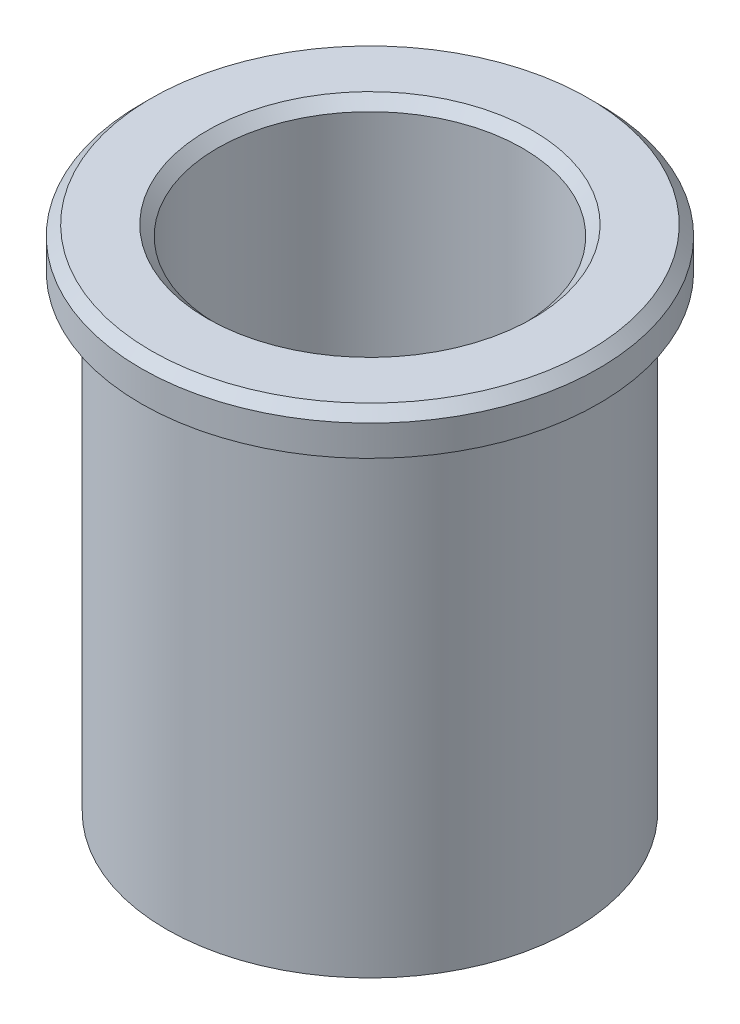
ISO-10303-21;
HEADER;
FILE_DESCRIPTION(('STEP AP214'),'2;1');
FILE_NAME('part.step','',(''),(''),'','','');
FILE_SCHEMA(('AUTOMOTIVE_DESIGN { 1 0 10303 214 1 1 1 1 }'));
ENDSEC;
DATA;
#1=APPLICATION_CONTEXT('core data for automotive mechanical design processes');
#2=APPLICATION_PROTOCOL_DEFINITION('international standard','automotive_design',2000,#1);
#3=PRODUCT_CONTEXT('',#1,'mechanical');
#4=PRODUCT('Part','Part','',(#3));
#5=PRODUCT_RELATED_PRODUCT_CATEGORY('part','',(#4));
#6=PRODUCT_DEFINITION_FORMATION('','',#4);
#7=PRODUCT_DEFINITION_CONTEXT('part definition',#1,'design');
#8=PRODUCT_DEFINITION('design','',#6,#7);
#9=PRODUCT_DEFINITION_SHAPE('','',#8);
#10=(LENGTH_UNIT() NAMED_UNIT(*) SI_UNIT(.MILLI.,.METRE.));
#11=(NAMED_UNIT(*) PLANE_ANGLE_UNIT() SI_UNIT($,.RADIAN.));
#12=(NAMED_UNIT(*) SI_UNIT($,.STERADIAN.) SOLID_ANGLE_UNIT());
#13=UNCERTAINTY_MEASURE_WITH_UNIT(LENGTH_MEASURE(1.E-05),#10,'distance_accuracy_value','');
#14=(GEOMETRIC_REPRESENTATION_CONTEXT(3) GLOBAL_UNCERTAINTY_ASSIGNED_CONTEXT((#13)) GLOBAL_UNIT_ASSIGNED_CONTEXT((#10,
#11,#12)) REPRESENTATION_CONTEXT('',''));
#15=CARTESIAN_POINT('',(0.,0.,0.));
#16=DIRECTION('',(0.,0.,1.));
#17=DIRECTION('',(1.,0.,0.));
#18=AXIS2_PLACEMENT_3D('',#15,#16,#17);
#19=CARTESIAN_POINT('',(22.5,-4.,0.));
#20=DIRECTION('',(0.,1.,0.));
#21=DIRECTION('',(0.,0.,1.));
#22=AXIS2_PLACEMENT_3D('',#19,#20,#21);
#23=PLANE('',#22);
#24=CARTESIAN_POINT('',(0.,-4.,0.));
#25=DIRECTION('',(0.,1.,0.));
#26=DIRECTION('',(0.,0.,1.));
#27=AXIS2_PLACEMENT_3D('',#24,#25,#26);
#28=CIRCLE('',#27,22.5);
#29=CARTESIAN_POINT('',(0.,-4.,22.5));
#30=VERTEX_POINT('',#29);
#31=EDGE_CURVE('E65',#30,#30,#28,.T.);
#32=ORIENTED_EDGE('',*,*,#31,.F.);
#33=EDGE_LOOP('',(#32));
#34=FACE_BOUND('',#33,.T.);
#35=CARTESIAN_POINT('',(0.,-4.,0.));
#36=DIRECTION('',(0.,1.,0.));
#37=DIRECTION('',(0.,0.,1.));
#38=AXIS2_PLACEMENT_3D('',#35,#36,#37);
#39=CIRCLE('',#38,20.);
#40=CARTESIAN_POINT('',(0.,-4.,20.));
#41=VERTEX_POINT('',#40);
#42=EDGE_CURVE('E10',#41,#41,#39,.T.);
#43=ORIENTED_EDGE('',*,*,#42,.T.);
#44=EDGE_LOOP('',(#43));
#45=FACE_BOUND('',#44,.T.);
#46=ADVANCED_FACE('F33',(#34,#45),#23,.F.);
#47=CARTESIAN_POINT('',(0.,22.6164383561644,0.));
#48=DIRECTION('',(0.,1.,0.));
#49=DIRECTION('',(0.,0.,1.));
#50=AXIS2_PLACEMENT_3D('',#47,#48,#49);
#51=CYLINDRICAL_SURFACE('',#50,20.);
#52=ORIENTED_EDGE('',*,*,#42,.F.);
#53=EDGE_LOOP('',(#52));
#54=FACE_BOUND('',#53,.T.);
#55=CARTESIAN_POINT('',(0.,-50.,0.));
#56=DIRECTION('',(0.,1.,0.));
#57=DIRECTION('',(0.,0.,1.));
#58=AXIS2_PLACEMENT_3D('',#55,#56,#57);
#59=CIRCLE('',#58,20.);
#60=CARTESIAN_POINT('',(0.,-50.,20.));
#61=VERTEX_POINT('',#60);
#62=EDGE_CURVE('E39',#61,#61,#59,.T.);
#63=ORIENTED_EDGE('',*,*,#62,.T.);
#64=EDGE_LOOP('',(#63));
#65=FACE_BOUND('',#64,.T.);
#66=ADVANCED_FACE('F72',(#54,#65),#51,.T.);
#67=CARTESIAN_POINT('',(20.,-50.,0.));
#68=DIRECTION('',(0.,1.,0.));
#69=DIRECTION('',(0.,0.,1.));
#70=AXIS2_PLACEMENT_3D('',#67,#68,#69);
#71=PLANE('',#70);
#72=ORIENTED_EDGE('',*,*,#62,.F.);
#73=EDGE_LOOP('',(#72));
#74=FACE_BOUND('',#73,.T.);
#75=CARTESIAN_POINT('',(0.,-50.,0.));
#76=DIRECTION('',(0.,1.,0.));
#77=DIRECTION('',(0.,0.,1.));
#78=AXIS2_PLACEMENT_3D('',#75,#76,#77);
#79=CIRCLE('',#78,16.);
#80=CARTESIAN_POINT('',(0.,-50.,16.));
#81=VERTEX_POINT('',#80);
#82=EDGE_CURVE('E43',#81,#81,#79,.T.);
#83=ORIENTED_EDGE('',*,*,#82,.T.);
#84=EDGE_LOOP('',(#83));
#85=FACE_BOUND('',#84,.T.);
#86=ADVANCED_FACE('F76',(#74,#85),#71,.F.);
#87=CARTESIAN_POINT('',(0.,-49.,0.));
#88=DIRECTION('',(0.,-1.,0.));
#89=DIRECTION('',(0.,0.,-1.));
#90=AXIS2_PLACEMENT_3D('',#87,#88,#89);
#91=CONICAL_SURFACE('',#90,15.,0.785398163397448);
#92=ORIENTED_EDGE('',*,*,#82,.F.);
#93=EDGE_LOOP('',(#92));
#94=FACE_BOUND('',#93,.T.);
#95=CARTESIAN_POINT('',(0.,-49.,0.));
#96=DIRECTION('',(0.,1.,0.));
#97=DIRECTION('',(0.,0.,1.));
#98=AXIS2_PLACEMENT_3D('',#95,#96,#97);
#99=CIRCLE('',#98,15.);
#100=CARTESIAN_POINT('',(0.,-49.,15.));
#101=VERTEX_POINT('',#100);
#102=EDGE_CURVE('E47',#101,#101,#99,.T.);
#103=ORIENTED_EDGE('',*,*,#102,.T.);
#104=EDGE_LOOP('',(#103));
#105=FACE_BOUND('',#104,.T.);
#106=ADVANCED_FACE('F81',(#94,#105),#91,.F.);
#107=CARTESIAN_POINT('',(0.,22.6164383561644,0.));
#108=DIRECTION('',(0.,1.,0.));
#109=DIRECTION('',(0.,0.,1.));
#110=AXIS2_PLACEMENT_3D('',#107,#108,#109);
#111=CYLINDRICAL_SURFACE('',#110,15.);
#112=ORIENTED_EDGE('',*,*,#102,.F.);
#113=EDGE_LOOP('',(#112));
#114=FACE_BOUND('',#113,.T.);
#115=CARTESIAN_POINT('',(0.,-1.,0.));
#116=DIRECTION('',(0.,1.,0.));
#117=DIRECTION('',(0.,0.,1.));
#118=AXIS2_PLACEMENT_3D('',#115,#116,#117);
#119=CIRCLE('',#118,15.);
#120=CARTESIAN_POINT('',(0.,-1.,15.));
#121=VERTEX_POINT('',#120);
#122=EDGE_CURVE('E52',#121,#121,#119,.T.);
#123=ORIENTED_EDGE('',*,*,#122,.T.);
#124=EDGE_LOOP('',(#123));
#125=FACE_BOUND('',#124,.T.);
#126=ADVANCED_FACE('F87',(#114,#125),#111,.F.);
#127=CARTESIAN_POINT('',(0.,0.,0.));
#128=DIRECTION('',(0.,1.,0.));
#129=DIRECTION('',(0.,0.,1.));
#130=AXIS2_PLACEMENT_3D('',#127,#128,#129);
#131=CONICAL_SURFACE('',#130,16.,0.785398163397448);
#132=ORIENTED_EDGE('',*,*,#122,.F.);
#133=EDGE_LOOP('',(#132));
#134=FACE_BOUND('',#133,.T.);
#135=CARTESIAN_POINT('',(0.,0.,0.));
#136=DIRECTION('',(0.,1.,0.));
#137=DIRECTION('',(0.,0.,1.));
#138=AXIS2_PLACEMENT_3D('',#135,#136,#137);
#139=CIRCLE('',#138,16.);
#140=CARTESIAN_POINT('',(0.,0.,16.));
#141=VERTEX_POINT('',#140);
#142=EDGE_CURVE('E55',#141,#141,#139,.T.);
#143=ORIENTED_EDGE('',*,*,#142,.T.);
#144=EDGE_LOOP('',(#143));
#145=FACE_BOUND('',#144,.T.);
#146=ADVANCED_FACE('F91',(#134,#145),#131,.F.);
#147=CARTESIAN_POINT('',(16.,0.,0.));
#148=DIRECTION('',(0.,-1.,0.));
#149=DIRECTION('',(0.,0.,-1.));
#150=AXIS2_PLACEMENT_3D('',#147,#148,#149);
#151=PLANE('',#150);
#152=ORIENTED_EDGE('',*,*,#142,.F.);
#153=EDGE_LOOP('',(#152));
#154=FACE_BOUND('',#153,.T.);
#155=CARTESIAN_POINT('',(0.,0.,0.));
#156=DIRECTION('',(0.,1.,0.));
#157=DIRECTION('',(0.,0.,1.));
#158=AXIS2_PLACEMENT_3D('',#155,#156,#157);
#159=CIRCLE('',#158,21.5);
#160=CARTESIAN_POINT('',(0.,0.,21.5));
#161=VERTEX_POINT('',#160);
#162=EDGE_CURVE('E59',#161,#161,#159,.T.);
#163=ORIENTED_EDGE('',*,*,#162,.T.);
#164=EDGE_LOOP('',(#163));
#165=FACE_BOUND('',#164,.T.);
#166=ADVANCED_FACE('F95',(#154,#165),#151,.F.);
#167=CARTESIAN_POINT('',(0.,-1.,0.));
#168=DIRECTION('',(0.,-1.,0.));
#169=DIRECTION('',(0.,0.,-1.));
#170=AXIS2_PLACEMENT_3D('',#167,#168,#169);
#171=CONICAL_SURFACE('',#170,22.5,0.785398163397448);
#172=ORIENTED_EDGE('',*,*,#162,.F.);
#173=EDGE_LOOP('',(#172));
#174=FACE_BOUND('',#173,.T.);
#175=CARTESIAN_POINT('',(0.,-1.,0.));
#176=DIRECTION('',(0.,1.,0.));
#177=DIRECTION('',(0.,0.,1.));
#178=AXIS2_PLACEMENT_3D('',#175,#176,#177);
#179=CIRCLE('',#178,22.5);
#180=CARTESIAN_POINT('',(0.,-1.,22.5));
#181=VERTEX_POINT('',#180);
#182=EDGE_CURVE('E62',#181,#181,#179,.T.);
#183=ORIENTED_EDGE('',*,*,#182,.T.);
#184=EDGE_LOOP('',(#183));
#185=FACE_BOUND('',#184,.T.);
#186=ADVANCED_FACE('F99',(#174,#185),#171,.T.);
#187=CARTESIAN_POINT('',(0.,22.6164383561644,0.));
#188=DIRECTION('',(0.,1.,0.));
#189=DIRECTION('',(0.,0.,1.));
#190=AXIS2_PLACEMENT_3D('',#187,#188,#189);
#191=CYLINDRICAL_SURFACE('',#190,22.5);
#192=ORIENTED_EDGE('',*,*,#182,.F.);
#193=EDGE_LOOP('',(#192));
#194=FACE_BOUND('',#193,.T.);
#195=ORIENTED_EDGE('',*,*,#31,.T.);
#196=EDGE_LOOP('',(#195));
#197=FACE_BOUND('',#196,.T.);
#198=ADVANCED_FACE('F69',(#194,#197),#191,.T.);
#199=CLOSED_SHELL('',(#46,#66,#86,#106,#126,#146,#166,#186,#198));
#200=MANIFOLD_SOLID_BREP('B2',#199);
#201=ADVANCED_BREP_SHAPE_REPRESENTATION('',(#18,#200),#14);
#202=SHAPE_DEFINITION_REPRESENTATION(#9,#201);
ENDSEC;
END-ISO-10303-21;
